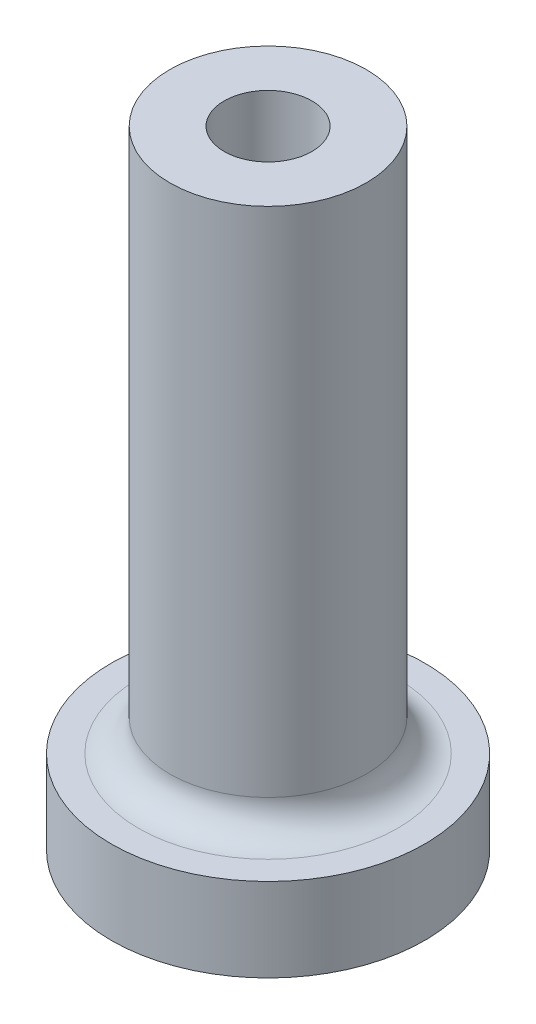
ISO-10303-21;
HEADER;
FILE_DESCRIPTION(('STEP AP214'),'2;1');
FILE_NAME('part.step','',(''),(''),'','','');
FILE_SCHEMA(('AUTOMOTIVE_DESIGN { 1 0 10303 214 1 1 1 1 }'));
ENDSEC;
DATA;
#1=APPLICATION_CONTEXT('core data for automotive mechanical design processes');
#2=APPLICATION_PROTOCOL_DEFINITION('international standard','automotive_design',2000,#1);
#3=PRODUCT_CONTEXT('',#1,'mechanical');
#4=PRODUCT('Part','Part','',(#3));
#5=PRODUCT_RELATED_PRODUCT_CATEGORY('part','',(#4));
#6=PRODUCT_DEFINITION_FORMATION('','',#4);
#7=PRODUCT_DEFINITION_CONTEXT('part definition',#1,'design');
#8=PRODUCT_DEFINITION('design','',#6,#7);
#9=PRODUCT_DEFINITION_SHAPE('','',#8);
#10=(LENGTH_UNIT() NAMED_UNIT(*) SI_UNIT(.MILLI.,.METRE.));
#11=(NAMED_UNIT(*) PLANE_ANGLE_UNIT() SI_UNIT($,.RADIAN.));
#12=(NAMED_UNIT(*) SI_UNIT($,.STERADIAN.) SOLID_ANGLE_UNIT());
#13=UNCERTAINTY_MEASURE_WITH_UNIT(LENGTH_MEASURE(1.E-05),#10,'distance_accuracy_value','');
#14=(GEOMETRIC_REPRESENTATION_CONTEXT(3) GLOBAL_UNCERTAINTY_ASSIGNED_CONTEXT((#13)) GLOBAL_UNIT_ASSIGNED_CONTEXT((#10,
#11,#12)) REPRESENTATION_CONTEXT('',''));
#15=CARTESIAN_POINT('',(0.,0.,0.));
#16=DIRECTION('',(0.,0.,1.));
#17=DIRECTION('',(1.,0.,0.));
#18=AXIS2_PLACEMENT_3D('',#15,#16,#17);
#19=CARTESIAN_POINT('',(0.,4.,0.));
#20=DIRECTION('',(0.,-1.,0.));
#21=DIRECTION('',(0.,0.,-1.));
#22=AXIS2_PLACEMENT_3D('',#19,#20,#21);
#23=CYLINDRICAL_SURFACE('',#22,7.5);
#24=CARTESIAN_POINT('',(0.,4.,0.));
#25=DIRECTION('',(0.,1.,0.));
#26=DIRECTION('',(0.,0.,1.));
#27=AXIS2_PLACEMENT_3D('',#24,#25,#26);
#28=CIRCLE('',#27,7.5);
#29=CARTESIAN_POINT('',(0.,4.,7.5));
#30=VERTEX_POINT('',#29);
#31=EDGE_CURVE('E48',#30,#30,#28,.T.);
#32=ORIENTED_EDGE('',*,*,#31,.F.);
#33=EDGE_LOOP('',(#32));
#34=FACE_BOUND('',#33,.T.);
#35=CARTESIAN_POINT('',(0.,0.,0.));
#36=DIRECTION('',(0.,1.,0.));
#37=DIRECTION('',(0.,0.,1.));
#38=AXIS2_PLACEMENT_3D('',#35,#36,#37);
#39=CIRCLE('',#38,7.5);
#40=CARTESIAN_POINT('',(0.,0.,7.5));
#41=VERTEX_POINT('',#40);
#42=EDGE_CURVE('E52',#41,#41,#39,.T.);
#43=ORIENTED_EDGE('',*,*,#42,.T.);
#44=EDGE_LOOP('',(#43));
#45=FACE_BOUND('',#44,.T.);
#46=ADVANCED_FACE('F37',(#34,#45),#23,.T.);
#47=CARTESIAN_POINT('',(0.,4.,0.));
#48=DIRECTION('',(0.,1.,0.));
#49=DIRECTION('',(0.,0.,1.));
#50=AXIS2_PLACEMENT_3D('',#47,#48,#49);
#51=PLANE('',#50);
#52=CARTESIAN_POINT('',(0.,4.,0.));
#53=DIRECTION('',(0.,1.,0.));
#54=DIRECTION('',(0.,0.,1.));
#55=AXIS2_PLACEMENT_3D('',#52,#53,#54);
#56=CIRCLE('',#55,6.2);
#57=CARTESIAN_POINT('',(0.,4.,6.2));
#58=VERTEX_POINT('',#57);
#59=EDGE_CURVE('E10',#58,#58,#56,.F.);
#60=ORIENTED_EDGE('',*,*,#59,.T.);
#61=EDGE_LOOP('',(#60));
#62=FACE_BOUND('',#61,.T.);
#63=ORIENTED_EDGE('',*,*,#31,.T.);
#64=EDGE_LOOP('',(#63));
#65=FACE_BOUND('',#64,.T.);
#66=ADVANCED_FACE('F90',(#62,#65),#51,.T.);
#67=CARTESIAN_POINT('',(0.,0.,0.));
#68=DIRECTION('',(0.,1.,0.));
#69=DIRECTION('',(0.,0.,1.));
#70=AXIS2_PLACEMENT_3D('',#67,#68,#69);
#71=PLANE('',#70);
#72=ORIENTED_EDGE('',*,*,#42,.F.);
#73=EDGE_LOOP('',(#72));
#74=FACE_BOUND('',#73,.T.);
#75=ADVANCED_FACE('F83',(#74),#71,.F.);
#76=CARTESIAN_POINT('',(0.,30.,0.));
#77=DIRECTION('',(0.,-1.,0.));
#78=DIRECTION('',(0.,0.,-1.));
#79=AXIS2_PLACEMENT_3D('',#76,#77,#78);
#80=CYLINDRICAL_SURFACE('',#79,4.7);
#81=CARTESIAN_POINT('',(0.,5.5,0.));
#82=DIRECTION('',(0.,1.,0.));
#83=DIRECTION('',(0.,0.,1.));
#84=AXIS2_PLACEMENT_3D('',#81,#82,#83);
#85=CIRCLE('',#84,4.7);
#86=CARTESIAN_POINT('',(0.,5.49999999999999,-4.7));
#87=VERTEX_POINT('',#86);
#88=EDGE_CURVE('E44',#87,#87,#85,.T.);
#89=CARTESIAN_POINT('',(0.,30.,0.));
#90=DIRECTION('',(0.,1.,0.));
#91=DIRECTION('',(0.,0.,1.));
#92=AXIS2_PLACEMENT_3D('',#89,#90,#91);
#93=CIRCLE('',#92,4.7);
#94=CARTESIAN_POINT('',(0.,30.,-4.7));
#95=VERTEX_POINT('',#94);
#96=EDGE_CURVE('E56',#95,#95,#93,.T.);
#97=CARTESIAN_POINT('',(0.,5.49999999999999,-4.7));
#98=CARTESIAN_POINT('',(0.,5.75520833333333,-4.7));
#99=CARTESIAN_POINT('',(0.,6.01041666666666,-4.7));
#100=CARTESIAN_POINT('',(0.,6.52083333333333,-4.7));
#101=CARTESIAN_POINT('',(0.,6.77604166666666,-4.7));
#102=CARTESIAN_POINT('',(0.,7.28645833333333,-4.7));
#103=CARTESIAN_POINT('',(0.,7.54166666666666,-4.7));
#104=CARTESIAN_POINT('',(0.,8.05208333333333,-4.7));
#105=CARTESIAN_POINT('',(0.,8.30729166666666,-4.7));
#106=CARTESIAN_POINT('',(0.,8.81770833333333,-4.7));
#107=CARTESIAN_POINT('',(0.,9.07291666666666,-4.7));
#108=CARTESIAN_POINT('',(0.,9.58333333333333,-4.7));
#109=CARTESIAN_POINT('',(0.,9.83854166666666,-4.7));
#110=CARTESIAN_POINT('',(0.,10.3489583333333,-4.7));
#111=CARTESIAN_POINT('',(0.,10.6041666666667,-4.7));
#112=CARTESIAN_POINT('',(0.,11.1145833333333,-4.7));
#113=CARTESIAN_POINT('',(0.,11.3697916666667,-4.7));
#114=CARTESIAN_POINT('',(0.,11.8802083333333,-4.7));
#115=CARTESIAN_POINT('',(0.,12.1354166666667,-4.7));
#116=CARTESIAN_POINT('',(0.,12.6458333333333,-4.7));
#117=CARTESIAN_POINT('',(0.,12.9010416666667,-4.7));
#118=CARTESIAN_POINT('',(0.,13.4114583333333,-4.7));
#119=CARTESIAN_POINT('',(0.,13.6666666666667,-4.7));
#120=CARTESIAN_POINT('',(0.,14.1770833333333,-4.7));
#121=CARTESIAN_POINT('',(0.,14.4322916666667,-4.7));
#122=CARTESIAN_POINT('',(0.,14.9427083333333,-4.7));
#123=CARTESIAN_POINT('',(0.,15.1979166666667,-4.7));
#124=CARTESIAN_POINT('',(0.,15.7083333333333,-4.7));
#125=CARTESIAN_POINT('',(0.,15.9635416666667,-4.7));
#126=CARTESIAN_POINT('',(0.,16.4739583333333,-4.7));
#127=CARTESIAN_POINT('',(0.,16.7291666666667,-4.7));
#128=CARTESIAN_POINT('',(0.,17.2395833333333,-4.7));
#129=CARTESIAN_POINT('',(0.,17.4947916666667,-4.7));
#130=CARTESIAN_POINT('',(0.,18.0052083333333,-4.7));
#131=CARTESIAN_POINT('',(0.,18.2604166666667,-4.7));
#132=CARTESIAN_POINT('',(0.,18.7708333333333,-4.7));
#133=CARTESIAN_POINT('',(0.,19.0260416666667,-4.7));
#134=CARTESIAN_POINT('',(0.,19.5364583333333,-4.7));
#135=CARTESIAN_POINT('',(0.,19.7916666666667,-4.7));
#136=CARTESIAN_POINT('',(0.,20.3020833333333,-4.7));
#137=CARTESIAN_POINT('',(0.,20.5572916666667,-4.7));
#138=CARTESIAN_POINT('',(0.,21.0677083333333,-4.7));
#139=CARTESIAN_POINT('',(0.,21.3229166666667,-4.7));
#140=CARTESIAN_POINT('',(0.,21.8333333333333,-4.7));
#141=CARTESIAN_POINT('',(0.,22.0885416666667,-4.7));
#142=CARTESIAN_POINT('',(0.,22.5989583333333,-4.7));
#143=CARTESIAN_POINT('',(0.,22.8541666666667,-4.7));
#144=CARTESIAN_POINT('',(0.,23.3645833333333,-4.7));
#145=CARTESIAN_POINT('',(0.,23.6197916666667,-4.7));
#146=CARTESIAN_POINT('',(0.,24.1302083333333,-4.7));
#147=CARTESIAN_POINT('',(0.,24.3854166666667,-4.7));
#148=CARTESIAN_POINT('',(0.,24.8958333333333,-4.7));
#149=CARTESIAN_POINT('',(0.,25.1510416666667,-4.7));
#150=CARTESIAN_POINT('',(0.,25.6614583333333,-4.7));
#151=CARTESIAN_POINT('',(0.,25.9166666666667,-4.7));
#152=CARTESIAN_POINT('',(0.,26.4270833333333,-4.7));
#153=CARTESIAN_POINT('',(0.,26.6822916666667,-4.7));
#154=CARTESIAN_POINT('',(0.,27.1927083333333,-4.7));
#155=CARTESIAN_POINT('',(0.,27.4479166666667,-4.7));
#156=CARTESIAN_POINT('',(0.,27.9583333333333,-4.7));
#157=CARTESIAN_POINT('',(0.,28.2135416666667,-4.7));
#158=CARTESIAN_POINT('',(0.,28.7239583333333,-4.7));
#159=CARTESIAN_POINT('',(0.,28.9791666666667,-4.7));
#160=CARTESIAN_POINT('',(0.,29.4895833333333,-4.7));
#161=CARTESIAN_POINT('',(0.,29.7447916666667,-4.7));
#162=CARTESIAN_POINT('',(0.,30.,-4.7));
#163=B_SPLINE_CURVE_WITH_KNOTS('',3,(#97,#98,#99,#100,#101,#102,#103,#104,#105,#106,#107,#108,
#109,#110,#111,#112,#113,#114,#115,#116,#117,#118,#119,#120,#121,#122,#123,#124,#125,#126,#127,
#128,#129,#130,#131,#132,#133,#134,#135,#136,#137,#138,#139,#140,#141,#142,#143,#144,#145,#146,
#147,#148,#149,#150,#151,#152,#153,#154,#155,#156,#157,#158,#159,#160,#161,#162),.UNSPECIFIED.,
.F.,.F.,(4,2,2,2,2,2,2,2,2,2,2,2,2,2,2,2,2,2,2,2,2,2,2,2,2,2,2,2,2,2,2,2,4),(0.,
0.765624999999999,1.53125,2.296875,3.0625,3.828125,4.59375,5.359375,6.125,6.890625,7.65625,
8.421875,9.1875,9.953125,10.71875,11.484375,12.25,13.015625,13.78125,14.546875,15.3125,
16.078125,16.84375,17.609375,18.375,19.140625,19.90625,20.671875,21.4375,22.203125,22.96875,
23.734375,24.5),.UNSPECIFIED.);
#164=EDGE_CURVE('BSEAM78',#87,#95,#163,.T.);
#165=ORIENTED_EDGE('',*,*,#88,.T.);
#166=ORIENTED_EDGE('',*,*,#96,.F.);
#167=ORIENTED_EDGE('',*,*,#164,.T.);
#168=ORIENTED_EDGE('',*,*,#164,.F.);
#169=EDGE_LOOP('',(#165,#167,#166,#168));
#170=FACE_BOUND('',#169,.T.);
#171=ADVANCED_FACE('F78',(#170),#80,.T.);
#172=CARTESIAN_POINT('',(0.,30.,0.));
#173=DIRECTION('',(0.,1.,0.));
#174=DIRECTION('',(0.,0.,1.));
#175=AXIS2_PLACEMENT_3D('',#172,#173,#174);
#176=PLANE('',#175);
#177=CARTESIAN_POINT('',(0.,30.,0.));
#178=DIRECTION('',(0.,1.,0.));
#179=DIRECTION('',(0.,0.,1.));
#180=AXIS2_PLACEMENT_3D('',#177,#178,#179);
#181=CIRCLE('',#180,2.1);
#182=CARTESIAN_POINT('',(0.,30.,2.1));
#183=VERTEX_POINT('',#182);
#184=EDGE_CURVE('E61',#183,#183,#181,.T.);
#185=ORIENTED_EDGE('',*,*,#184,.F.);
#186=EDGE_LOOP('',(#185));
#187=FACE_BOUND('',#186,.T.);
#188=ORIENTED_EDGE('',*,*,#96,.T.);
#189=EDGE_LOOP('',(#188));
#190=FACE_BOUND('',#189,.T.);
#191=ADVANCED_FACE('F72',(#187,#190),#176,.T.);
#192=CARTESIAN_POINT('',(0.,20.,0.));
#193=DIRECTION('',(0.,1.,0.));
#194=DIRECTION('',(0.,0.,1.));
#195=AXIS2_PLACEMENT_3D('',#192,#193,#194);
#196=CYLINDRICAL_SURFACE('',#195,2.1);
#197=CARTESIAN_POINT('',(0.,20.,0.));
#198=DIRECTION('',(0.,1.,0.));
#199=DIRECTION('',(0.,0.,1.));
#200=AXIS2_PLACEMENT_3D('',#197,#198,#199);
#201=CIRCLE('',#200,2.1);
#202=CARTESIAN_POINT('',(0.,20.,2.1));
#203=VERTEX_POINT('',#202);
#204=EDGE_CURVE('E60',#203,#203,#201,.T.);
#205=ORIENTED_EDGE('',*,*,#204,.F.);
#206=EDGE_LOOP('',(#205));
#207=FACE_BOUND('',#206,.T.);
#208=ORIENTED_EDGE('',*,*,#184,.T.);
#209=EDGE_LOOP('',(#208));
#210=FACE_BOUND('',#209,.T.);
#211=ADVANCED_FACE('F69',(#207,#210),#196,.F.);
#212=CARTESIAN_POINT('',(0.,20.,0.));
#213=DIRECTION('',(0.,1.,0.));
#214=DIRECTION('',(0.,0.,1.));
#215=AXIS2_PLACEMENT_3D('',#212,#213,#214);
#216=PLANE('',#215);
#217=ORIENTED_EDGE('',*,*,#204,.T.);
#218=EDGE_LOOP('',(#217));
#219=FACE_BOUND('',#218,.T.);
#220=ADVANCED_FACE('F67',(#219),#216,.T.);
#221=CARTESIAN_POINT('',(0.,5.5,0.));
#222=DIRECTION('',(0.,1.,0.));
#223=DIRECTION('',(0.,0.,1.));
#224=AXIS2_PLACEMENT_3D('',#221,#222,#223);
#225=TOROIDAL_SURFACE('',#224,6.2,1.5);
#226=ORIENTED_EDGE('',*,*,#59,.F.);
#227=EDGE_LOOP('',(#226));
#228=FACE_BOUND('',#227,.T.);
#229=ORIENTED_EDGE('',*,*,#88,.F.);
#230=EDGE_LOOP('',(#229));
#231=FACE_BOUND('',#230,.T.);
#232=ADVANCED_FACE('F39',(#228,#231),#225,.F.);
#233=CLOSED_SHELL('',(#46,#66,#75,#171,#191,#211,#220,#232));
#234=MANIFOLD_SOLID_BREP('B2',#233);
#235=ADVANCED_BREP_SHAPE_REPRESENTATION('',(#18,#234),#14);
#236=SHAPE_DEFINITION_REPRESENTATION(#9,#235);
ENDSEC;
END-ISO-10303-21;
